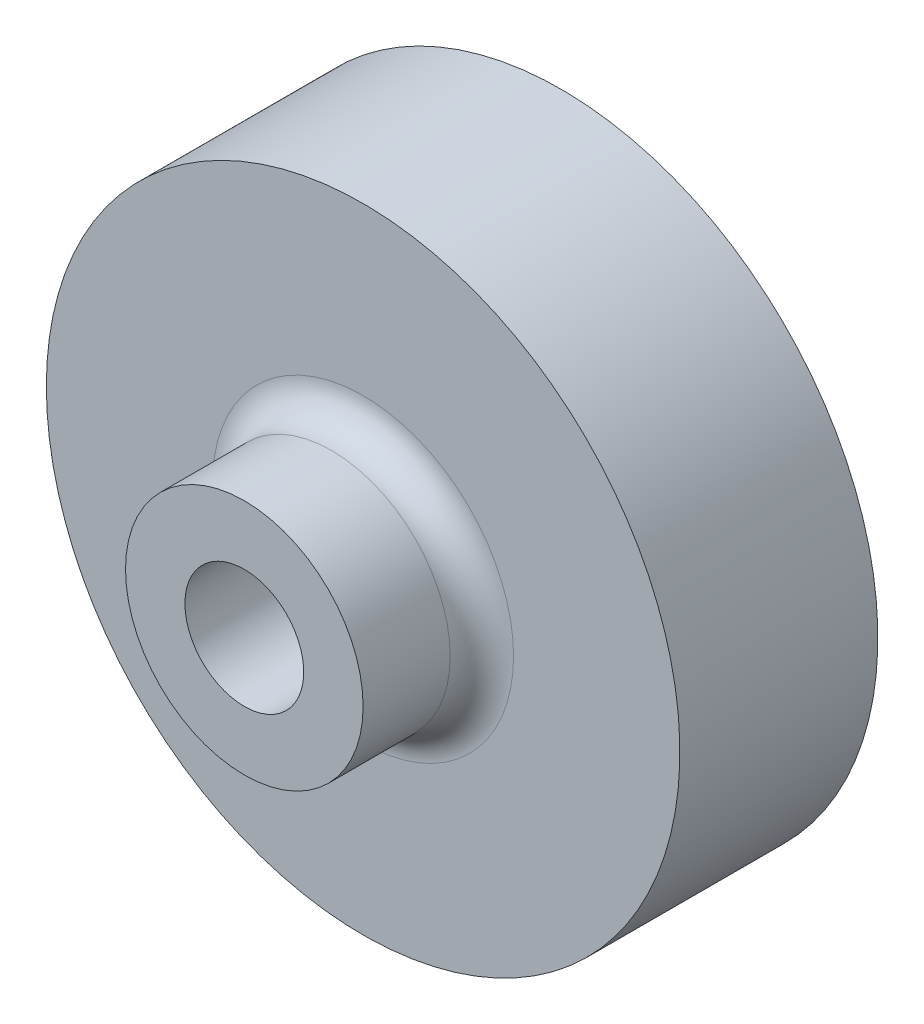
ISO-10303-21;
HEADER;
FILE_DESCRIPTION(('STEP AP214'),'2;1');
FILE_NAME('part.step','',(''),(''),'','','');
FILE_SCHEMA(('AUTOMOTIVE_DESIGN { 1 0 10303 214 1 1 1 1 }'));
ENDSEC;
DATA;
#1=APPLICATION_CONTEXT('core data for automotive mechanical design processes');
#2=APPLICATION_PROTOCOL_DEFINITION('international standard','automotive_design',2000,#1);
#3=PRODUCT_CONTEXT('',#1,'mechanical');
#4=PRODUCT('Part','Part','',(#3));
#5=PRODUCT_RELATED_PRODUCT_CATEGORY('part','',(#4));
#6=PRODUCT_DEFINITION_FORMATION('','',#4);
#7=PRODUCT_DEFINITION_CONTEXT('part definition',#1,'design');
#8=PRODUCT_DEFINITION('design','',#6,#7);
#9=PRODUCT_DEFINITION_SHAPE('','',#8);
#10=(LENGTH_UNIT() NAMED_UNIT(*) SI_UNIT(.MILLI.,.METRE.));
#11=(NAMED_UNIT(*) PLANE_ANGLE_UNIT() SI_UNIT($,.RADIAN.));
#12=(NAMED_UNIT(*) SI_UNIT($,.STERADIAN.) SOLID_ANGLE_UNIT());
#13=UNCERTAINTY_MEASURE_WITH_UNIT(LENGTH_MEASURE(1.E-05),#10,'distance_accuracy_value','');
#14=(GEOMETRIC_REPRESENTATION_CONTEXT(3) GLOBAL_UNCERTAINTY_ASSIGNED_CONTEXT((#13)) GLOBAL_UNIT_ASSIGNED_CONTEXT((#10,
#11,#12)) REPRESENTATION_CONTEXT('',''));
#15=CARTESIAN_POINT('',(0.,0.,0.));
#16=DIRECTION('',(0.,0.,1.));
#17=DIRECTION('',(1.,0.,0.));
#18=AXIS2_PLACEMENT_3D('',#15,#16,#17);
#19=CARTESIAN_POINT('',(-1.27000000000004,-1.52655665885959E-13,0.));
#20=DIRECTION('',(1.,0.,0.));
#21=DIRECTION('',(0.,1.,0.));
#22=AXIS2_PLACEMENT_3D('',#19,#20,#21);
#23=PLANE('',#22);
#24=DIRECTION('',(0.,-1.,0.));
#25=VECTOR('',#24,1.);
#26=CARTESIAN_POINT('',(-1.27000000000016,-6.17561557447743E-13,-22.2250000000002));
#27=LINE('',#26,#25);
#28=CARTESIAN_POINT('',(-1.27,4.59004425359881,-22.2250000000002));
#29=VERTEX_POINT('',#28);
#30=CARTESIAN_POINT('',(-1.27000000000003,-4.59004425359939,-22.225));
#31=VERTEX_POINT('',#30);
#32=EDGE_CURVE('E95',#29,#31,#27,.T.);
#33=ORIENTED_EDGE('',*,*,#32,.F.);
#34=DIRECTION('',(0.,0.,-1.));
#35=VECTOR('',#34,1.);
#36=CARTESIAN_POINT('',(-1.27000000000001,4.5900442535993,0.));
#37=LINE('',#36,#35);
#38=CARTESIAN_POINT('',(-1.26999999999993,4.59004425359906,-25.4000000000002));
#39=VERTEX_POINT('',#38);
#40=EDGE_CURVE('E104',#29,#39,#37,.T.);
#41=ORIENTED_EDGE('',*,*,#40,.T.);
#42=DIRECTION('',(0.,-1.,0.));
#43=VECTOR('',#42,1.);
#44=CARTESIAN_POINT('',(-1.27000000000015,-5.82867087928207E-13,-25.4));
#45=LINE('',#44,#43);
#46=CARTESIAN_POINT('',(-1.27000000000003,-4.59004425359939,-25.4));
#47=VERTEX_POINT('',#46);
#48=EDGE_CURVE('E197',#39,#47,#45,.T.);
#49=ORIENTED_EDGE('',*,*,#48,.T.);
#50=DIRECTION('',(0.,0.,-1.));
#51=VECTOR('',#50,1.);
#52=CARTESIAN_POINT('',(-1.27000000000003,-4.59004425359938,0.));
#53=LINE('',#52,#51);
#54=EDGE_CURVE('E106',#31,#47,#53,.T.);
#55=ORIENTED_EDGE('',*,*,#54,.F.);
#56=EDGE_LOOP('',(#33,#41,#49,#55));
#57=FACE_BOUND('',#56,.T.);
#58=ADVANCED_FACE('F52',(#57),#23,.F.);
#59=CARTESIAN_POINT('',(1.27000000000001,0.,0.));
#60=DIRECTION('',(1.,0.,0.));
#61=DIRECTION('',(0.,0.,-1.));
#62=AXIS2_PLACEMENT_3D('',#59,#60,#61);
#63=PLANE('',#62);
#64=DIRECTION('',(0.,0.,-1.));
#65=VECTOR('',#64,1.);
#66=CARTESIAN_POINT('',(1.27000000000001,4.59004425359928,0.));
#67=LINE('',#66,#65);
#68=CARTESIAN_POINT('',(1.26999999999997,4.59004425359862,-22.2250000000002));
#69=VERTEX_POINT('',#68);
#70=CARTESIAN_POINT('',(1.27000000000007,4.59004425359898,-25.4000000000002));
#71=VERTEX_POINT('',#70);
#72=EDGE_CURVE('E75',#69,#71,#67,.T.);
#73=ORIENTED_EDGE('',*,*,#72,.F.);
#74=DIRECTION('',(0.,1.,0.));
#75=VECTOR('',#74,1.);
#76=CARTESIAN_POINT('',(1.26999999999985,-7.14706072102445E-13,-22.2250000000002));
#77=LINE('',#76,#75);
#78=CARTESIAN_POINT('',(1.26999999999981,-4.59004425360005,-22.2250000000002));
#79=VERTEX_POINT('',#78);
#80=EDGE_CURVE('E68',#79,#69,#77,.T.);
#81=ORIENTED_EDGE('',*,*,#80,.F.);
#82=DIRECTION('',(0.,0.,-1.));
#83=VECTOR('',#82,1.);
#84=CARTESIAN_POINT('',(1.26999999999999,-4.59004425359934,0.));
#85=LINE('',#84,#83);
#86=CARTESIAN_POINT('',(1.26999999999981,-4.59004425360002,-25.4));
#87=VERTEX_POINT('',#86);
#88=EDGE_CURVE('E132',#79,#87,#85,.T.);
#89=ORIENTED_EDGE('',*,*,#88,.T.);
#90=DIRECTION('',(0.,-1.,0.));
#91=VECTOR('',#90,1.);
#92=CARTESIAN_POINT('',(1.27000000000001,0.,-25.4));
#93=LINE('',#92,#91);
#94=EDGE_CURVE('E115',#71,#87,#93,.T.);
#95=ORIENTED_EDGE('',*,*,#94,.F.);
#96=EDGE_LOOP('',(#73,#81,#89,#95));
#97=FACE_BOUND('',#96,.T.);
#98=ADVANCED_FACE('F155',(#97),#63,.T.);
#99=CARTESIAN_POINT('',(0.,0.,0.));
#100=DIRECTION('',(0.,0.,1.));
#101=DIRECTION('',(1.,0.,0.));
#102=AXIS2_PLACEMENT_3D('',#99,#100,#101);
#103=PLANE('',#102);
#104=CARTESIAN_POINT('',(0.,0.,0.));
#105=DIRECTION('',(0.,0.,-1.));
#106=DIRECTION('',(-1.,0.,0.));
#107=AXIS2_PLACEMENT_3D('',#104,#105,#106);
#108=CIRCLE('',#107,4.7625);
#109=CARTESIAN_POINT('',(-4.7625,0.,0.));
#110=VERTEX_POINT('',#109);
#111=EDGE_CURVE('E185',#110,#110,#108,.T.);
#112=ORIENTED_EDGE('',*,*,#111,.T.);
#113=EDGE_LOOP('',(#112));
#114=FACE_BOUND('',#113,.T.);
#115=CARTESIAN_POINT('',(0.,0.,0.));
#116=DIRECTION('',(0.,0.,-1.));
#117=DIRECTION('',(-1.,0.,0.));
#118=AXIS2_PLACEMENT_3D('',#115,#116,#117);
#119=CIRCLE('',#118,9.525);
#120=CARTESIAN_POINT('',(-9.525,0.,0.));
#121=VERTEX_POINT('',#120);
#122=EDGE_CURVE('E136',#121,#121,#119,.T.);
#123=ORIENTED_EDGE('',*,*,#122,.F.);
#124=EDGE_LOOP('',(#123));
#125=FACE_BOUND('',#124,.T.);
#126=ADVANCED_FACE('F160',(#114,#125),#103,.T.);
#127=CARTESIAN_POINT('',(-25.4,-4.85722573273506E-13,-25.4));
#128=DIRECTION('',(0.,0.,-1.));
#129=DIRECTION('',(-1.,0.,0.));
#130=AXIS2_PLACEMENT_3D('',#127,#128,#129);
#131=PLANE('',#130);
#132=ORIENTED_EDGE('',*,*,#48,.F.);
#133=CARTESIAN_POINT('',(0.,-4.64905891561784E-13,-25.4));
#134=DIRECTION('',(0.,0.,-1.));
#135=DIRECTION('',(-1.,0.,0.));
#136=AXIS2_PLACEMENT_3D('',#133,#134,#135);
#137=CIRCLE('',#136,4.7625);
#138=EDGE_CURVE('E112',#47,#39,#137,.T.);
#139=ORIENTED_EDGE('',*,*,#138,.F.);
#140=EDGE_LOOP('',(#132,#139));
#141=FACE_BOUND('',#140,.T.);
#142=CARTESIAN_POINT('',(0.,-4.64905891561784E-13,-25.4));
#143=DIRECTION('',(0.,0.,-1.));
#144=DIRECTION('',(-1.,0.,0.));
#145=AXIS2_PLACEMENT_3D('',#142,#143,#144);
#146=CIRCLE('',#145,25.4);
#147=CARTESIAN_POINT('',(-25.4,-4.64905891561784E-13,-25.4));
#148=VERTEX_POINT('',#147);
#149=EDGE_CURVE('E127',#148,#148,#146,.T.);
#150=ORIENTED_EDGE('',*,*,#149,.T.);
#151=EDGE_LOOP('',(#150));
#152=FACE_BOUND('',#151,.T.);
#153=CARTESIAN_POINT('',(0.,-4.64905891561784E-13,-25.4));
#154=DIRECTION('',(0.,0.,-1.));
#155=DIRECTION('',(-1.,0.,0.));
#156=AXIS2_PLACEMENT_3D('',#153,#154,#155);
#157=CIRCLE('',#156,4.7625);
#158=EDGE_CURVE('E121',#71,#87,#157,.T.);
#159=ORIENTED_EDGE('',*,*,#158,.F.);
#160=ORIENTED_EDGE('',*,*,#94,.T.);
#161=EDGE_LOOP('',(#159,#160));
#162=FACE_BOUND('',#161,.T.);
#163=ADVANCED_FACE('F165',(#141,#152,#162),#131,.T.);
#164=CARTESIAN_POINT('',(0.,-2.77555756156289E-13,-87.4067599551985));
#165=DIRECTION('',(0.,0.,-1.));
#166=DIRECTION('',(-1.,0.,0.));
#167=AXIS2_PLACEMENT_3D('',#164,#165,#166);
#168=CYLINDRICAL_SURFACE('',#167,9.525);
#169=CARTESIAN_POINT('',(0.,0.,-6.985));
#170=DIRECTION('',(0.,0.,1.));
#171=DIRECTION('',(1.,0.,0.));
#172=AXIS2_PLACEMENT_3D('',#169,#170,#171);
#173=CIRCLE('',#172,9.525);
#174=CARTESIAN_POINT('',(9.525,0.,-6.985));
#175=VERTEX_POINT('',#174);
#176=EDGE_CURVE('E13',#175,#175,#173,.T.);
#177=ORIENTED_EDGE('',*,*,#176,.T.);
#178=EDGE_LOOP('',(#177));
#179=FACE_BOUND('',#178,.T.);
#180=ORIENTED_EDGE('',*,*,#122,.T.);
#181=EDGE_LOOP('',(#180));
#182=FACE_BOUND('',#181,.T.);
#183=ADVANCED_FACE('F168',(#179,#182),#168,.T.);
#184=CARTESIAN_POINT('',(-9.525,-5.68989300120393E-13,-9.52500000000018));
#185=DIRECTION('',(0.,0.,1.));
#186=DIRECTION('',(1.,0.,0.));
#187=AXIS2_PLACEMENT_3D('',#184,#185,#186);
#188=PLANE('',#187);
#189=CARTESIAN_POINT('',(0.,-6.66133814775094E-13,-9.52500000000018));
#190=DIRECTION('',(0.,0.,1.));
#191=DIRECTION('',(1.,0.,0.));
#192=AXIS2_PLACEMENT_3D('',#189,#190,#191);
#193=CIRCLE('',#192,12.065);
#194=CARTESIAN_POINT('',(12.0650000000001,-6.66133814775094E-13,-9.52500000000018));
#195=VERTEX_POINT('',#194);
#196=EDGE_CURVE('E61',#195,#195,#193,.F.);
#197=ORIENTED_EDGE('',*,*,#196,.T.);
#198=EDGE_LOOP('',(#197));
#199=FACE_BOUND('',#198,.T.);
#200=CARTESIAN_POINT('',(0.,-6.66133814775094E-13,-9.52500000000018));
#201=DIRECTION('',(0.,0.,-1.));
#202=DIRECTION('',(-1.,0.,0.));
#203=AXIS2_PLACEMENT_3D('',#200,#201,#202);
#204=CIRCLE('',#203,25.4);
#205=CARTESIAN_POINT('',(-25.3999999999999,-6.66133814775094E-13,-9.52500000000018));
#206=VERTEX_POINT('',#205);
#207=EDGE_CURVE('E131',#206,#206,#204,.T.);
#208=ORIENTED_EDGE('',*,*,#207,.F.);
#209=EDGE_LOOP('',(#208));
#210=FACE_BOUND('',#209,.T.);
#211=ADVANCED_FACE('F144',(#199,#210),#188,.T.);
#212=CARTESIAN_POINT('',(0.,-2.77555756156289E-13,-87.4067599551985));
#213=DIRECTION('',(0.,0.,-1.));
#214=DIRECTION('',(-1.,0.,0.));
#215=AXIS2_PLACEMENT_3D('',#212,#213,#214);
#216=CYLINDRICAL_SURFACE('',#215,25.4);
#217=ORIENTED_EDGE('',*,*,#207,.T.);
#218=EDGE_LOOP('',(#217));
#219=FACE_BOUND('',#218,.T.);
#220=ORIENTED_EDGE('',*,*,#149,.F.);
#221=EDGE_LOOP('',(#220));
#222=FACE_BOUND('',#221,.T.);
#223=ADVANCED_FACE('F170',(#219,#222),#216,.T.);
#224=CARTESIAN_POINT('',(0.,0.,0.));
#225=DIRECTION('',(0.,0.,-1.));
#226=DIRECTION('',(-1.,0.,0.));
#227=AXIS2_PLACEMENT_3D('',#224,#225,#226);
#228=CYLINDRICAL_SURFACE('',#227,4.7625);
#229=ORIENTED_EDGE('',*,*,#40,.F.);
#230=CARTESIAN_POINT('',(0.,-4.64905891561784E-13,-22.2250000000002));
#231=DIRECTION('',(0.,0.,1.));
#232=DIRECTION('',(1.,0.,0.));
#233=AXIS2_PLACEMENT_3D('',#230,#231,#232);
#234=CIRCLE('',#233,4.7625);
#235=EDGE_CURVE('E92',#69,#29,#234,.T.);
#236=ORIENTED_EDGE('',*,*,#235,.F.);
#237=ORIENTED_EDGE('',*,*,#72,.T.);
#238=ORIENTED_EDGE('',*,*,#158,.T.);
#239=ORIENTED_EDGE('',*,*,#88,.F.);
#240=EDGE_CURVE('E100',#31,#79,#234,.T.);
#241=ORIENTED_EDGE('',*,*,#240,.F.);
#242=ORIENTED_EDGE('',*,*,#54,.T.);
#243=ORIENTED_EDGE('',*,*,#138,.T.);
#244=EDGE_LOOP('',(#229,#236,#237,#238,#239,#241,#242,#243));
#245=FACE_BOUND('',#244,.T.);
#246=ORIENTED_EDGE('',*,*,#111,.F.);
#247=EDGE_LOOP('',(#246));
#248=FACE_BOUND('',#247,.T.);
#249=ADVANCED_FACE('F109',(#245,#248),#228,.F.);
#250=CARTESIAN_POINT('',(0.,-4.64905891561784E-13,-22.2250000000002));
#251=DIRECTION('',(0.,0.,1.));
#252=DIRECTION('',(1.,0.,0.));
#253=AXIS2_PLACEMENT_3D('',#250,#251,#252);
#254=PLANE('',#253);
#255=ORIENTED_EDGE('',*,*,#80,.T.);
#256=ORIENTED_EDGE('',*,*,#235,.T.);
#257=ORIENTED_EDGE('',*,*,#32,.T.);
#258=ORIENTED_EDGE('',*,*,#240,.T.);
#259=EDGE_LOOP('',(#255,#256,#257,#258));
#260=FACE_BOUND('',#259,.T.);
#261=ADVANCED_FACE('F94',(#260),#254,.T.);
#262=CARTESIAN_POINT('',(0.,0.,-6.985));
#263=DIRECTION('',(0.,0.,1.));
#264=DIRECTION('',(1.,0.,0.));
#265=AXIS2_PLACEMENT_3D('',#262,#263,#264);
#266=TOROIDAL_SURFACE('',#265,12.065,2.54);
#267=ORIENTED_EDGE('',*,*,#176,.F.);
#268=EDGE_LOOP('',(#267));
#269=FACE_BOUND('',#268,.T.);
#270=ORIENTED_EDGE('',*,*,#196,.F.);
#271=EDGE_LOOP('',(#270));
#272=FACE_BOUND('',#271,.T.);
#273=ADVANCED_FACE('F54',(#269,#272),#266,.F.);
#274=CLOSED_SHELL('',(#58,#98,#126,#163,#183,#211,#223,#249,#261,#273));
#275=MANIFOLD_SOLID_BREP('B2',#274);
#276=ADVANCED_BREP_SHAPE_REPRESENTATION('',(#18,#275),#14);
#277=SHAPE_DEFINITION_REPRESENTATION(#9,#276);
ENDSEC;
END-ISO-10303-21;
